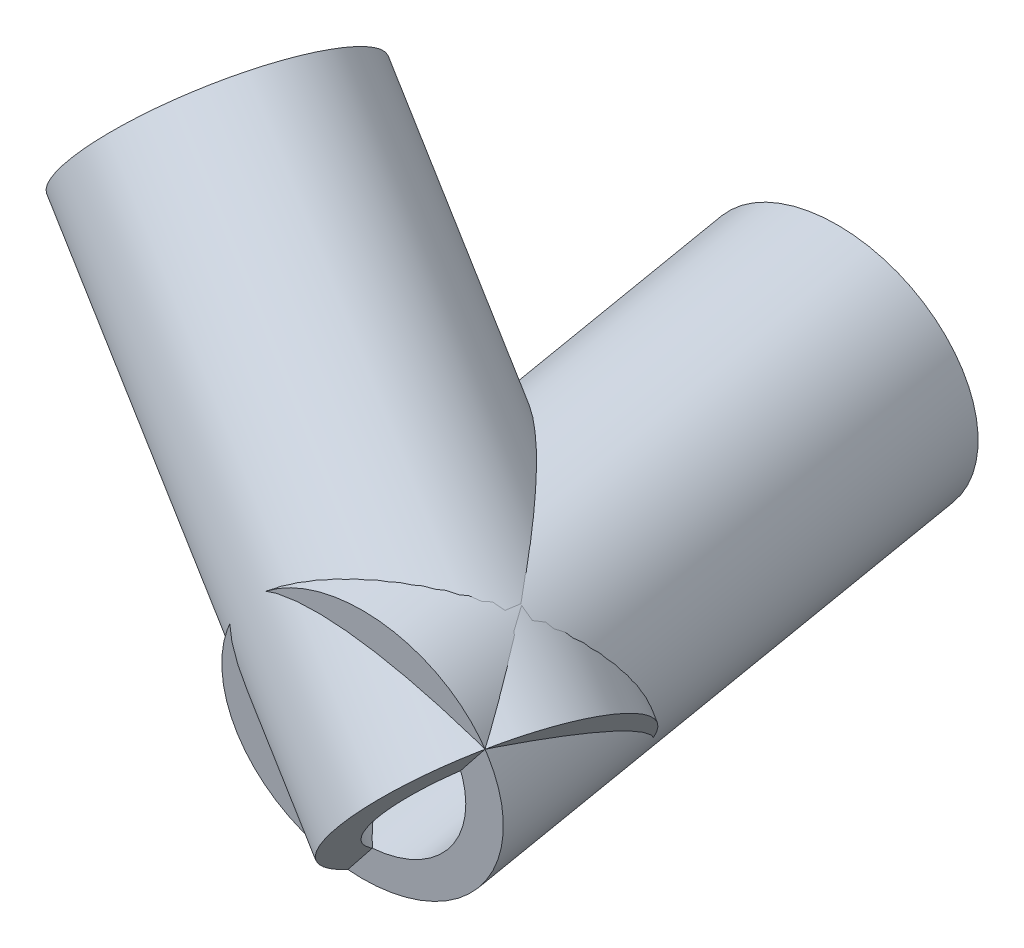
ISO-10303-21;
HEADER;
FILE_DESCRIPTION(('STEP AP214'),'2;1');
FILE_NAME('part.step','',(''),(''),'','','');
FILE_SCHEMA(('AUTOMOTIVE_DESIGN { 1 0 10303 214 1 1 1 1 }'));
ENDSEC;
DATA;
#1=APPLICATION_CONTEXT('core data for automotive mechanical design processes');
#2=APPLICATION_PROTOCOL_DEFINITION('international standard','automotive_design',2000,#1);
#3=PRODUCT_CONTEXT('',#1,'mechanical');
#4=PRODUCT('Part','Part','',(#3));
#5=PRODUCT_RELATED_PRODUCT_CATEGORY('part','',(#4));
#6=PRODUCT_DEFINITION_FORMATION('','',#4);
#7=PRODUCT_DEFINITION_CONTEXT('part definition',#1,'design');
#8=PRODUCT_DEFINITION('design','',#6,#7);
#9=PRODUCT_DEFINITION_SHAPE('','',#8);
#10=(LENGTH_UNIT() NAMED_UNIT(*) SI_UNIT(.MILLI.,.METRE.));
#11=(NAMED_UNIT(*) PLANE_ANGLE_UNIT() SI_UNIT($,.RADIAN.));
#12=(NAMED_UNIT(*) SI_UNIT($,.STERADIAN.) SOLID_ANGLE_UNIT());
#13=UNCERTAINTY_MEASURE_WITH_UNIT(LENGTH_MEASURE(1.E-05),#10,'distance_accuracy_value','');
#14=(GEOMETRIC_REPRESENTATION_CONTEXT(3) GLOBAL_UNCERTAINTY_ASSIGNED_CONTEXT((#13)) GLOBAL_UNIT_ASSIGNED_CONTEXT((#10,
#11,#12)) REPRESENTATION_CONTEXT('',''));
#15=CARTESIAN_POINT('',(0.,0.,0.));
#16=DIRECTION('',(0.,0.,1.));
#17=DIRECTION('',(1.,0.,0.));
#18=AXIS2_PLACEMENT_3D('',#15,#16,#17);
#19=CARTESIAN_POINT('',(-34.9878080110997,-17.9791132735098,-0.395982102381497));
#20=DIRECTION('',(0.752934660628481,-0.614285200098945,0.236099745369779));
#21=DIRECTION('',(0.632157021590929,0.774840306162041,0.));
#22=AXIS2_PLACEMENT_3D('',#19,#20,#21);
#23=PLANE('',#22);
#24=CARTESIAN_POINT('',(-26.1956533937152,-6.14285200098945,2.36099745369778));
#25=DIRECTION('',(0.752934660628481,-0.614285200098945,0.236099745369779));
#26=DIRECTION('',(0.632157021590929,0.774840306162041,0.));
#27=AXIS2_PLACEMENT_3D('',#24,#25,#26);
#28=CIRCLE('',#27,15.);
#29=CARTESIAN_POINT('',(-16.7132980698513,5.47975259144119,2.36099745369778));
#30=VERTEX_POINT('',#29);
#31=EDGE_CURVE('E51',#30,#30,#28,.T.);
#32=ORIENTED_EDGE('',*,*,#31,.T.);
#33=EDGE_LOOP('',(#32));
#34=FACE_BOUND('',#33,.T.);
#35=CARTESIAN_POINT('',(-26.1956533937152,-6.14285200098943,2.36099745369778));
#36=DIRECTION('',(0.752934660628481,-0.614285200098945,0.236099745369779));
#37=DIRECTION('',(0.632157021590929,0.774840306162041,0.));
#38=AXIS2_PLACEMENT_3D('',#35,#36,#37);
#39=CIRCLE('',#38,11.);
#40=CARTESIAN_POINT('',(-19.241926156215,2.38039136679302,2.36099745369778));
#41=VERTEX_POINT('',#40);
#42=EDGE_CURVE('E11',#41,#41,#39,.T.);
#43=ORIENTED_EDGE('',*,*,#42,.F.);
#44=EDGE_LOOP('',(#43));
#45=FACE_BOUND('',#44,.T.);
#46=ADVANCED_FACE('F45',(#34,#45),#23,.T.);
#47=CARTESIAN_POINT('',(-33.725,0.,0.));
#48=DIRECTION('',(0.752934660628481,-0.614285200098945,0.236099745369779));
#49=DIRECTION('',(0.632157021590929,0.774840306162041,0.));
#50=AXIS2_PLACEMENT_3D('',#47,#48,#49);
#51=CYLINDRICAL_SURFACE('',#50,15.);
#52=CARTESIAN_POINT('',(-71.3717330314241,30.7142600049472,-11.8049872684889));
#53=DIRECTION('',(0.752934660628481,-0.614285200098945,0.236099745369779));
#54=DIRECTION('',(0.632157021590929,0.774840306162041,0.));
#55=AXIS2_PLACEMENT_3D('',#52,#53,#54);
#56=CIRCLE('',#55,15.0000000000001);
#57=CARTESIAN_POINT('',(-61.8893777075601,42.3368645973779,-11.8049872684889));
#58=VERTEX_POINT('',#57);
#59=EDGE_CURVE('E55',#58,#58,#56,.T.);
#60=ORIENTED_EDGE('',*,*,#59,.T.);
#61=EDGE_LOOP('',(#60));
#62=FACE_BOUND('',#61,.T.);
#63=ORIENTED_EDGE('',*,*,#31,.F.);
#64=EDGE_LOOP('',(#63));
#65=FACE_BOUND('',#64,.T.);
#66=ADVANCED_FACE('F74',(#62,#65),#51,.T.);
#67=CARTESIAN_POINT('',(-80.1638876488086,18.8779987324268,-14.5619668245682));
#68=DIRECTION('',(-0.752934660628481,0.614285200098945,-0.236099745369779));
#69=DIRECTION('',(-0.632157021590929,-0.774840306162041,0.));
#70=AXIS2_PLACEMENT_3D('',#67,#68,#69);
#71=PLANE('',#70);
#72=CARTESIAN_POINT('',(-71.3717330314241,30.7142600049472,-11.8049872684889));
#73=DIRECTION('',(0.752934660628481,-0.614285200098945,0.236099745369779));
#74=DIRECTION('',(0.632157021590929,0.774840306162041,0.));
#75=AXIS2_PLACEMENT_3D('',#72,#73,#74);
#76=CIRCLE('',#75,11.);
#77=CARTESIAN_POINT('',(-64.4180057939238,39.2375033727297,-11.8049872684889));
#78=VERTEX_POINT('',#77);
#79=EDGE_CURVE('E59',#78,#78,#76,.T.);
#80=ORIENTED_EDGE('',*,*,#79,.T.);
#81=EDGE_LOOP('',(#80));
#82=FACE_BOUND('',#81,.T.);
#83=ORIENTED_EDGE('',*,*,#59,.F.);
#84=EDGE_LOOP('',(#83));
#85=FACE_BOUND('',#84,.T.);
#86=ADVANCED_FACE('F65',(#82,#85),#71,.T.);
#87=CARTESIAN_POINT('',(-33.725,0.,0.));
#88=DIRECTION('',(0.752934660628481,-0.614285200098945,0.236099745369779));
#89=DIRECTION('',(0.632157021590929,0.774840306162041,0.));
#90=AXIS2_PLACEMENT_3D('',#87,#88,#89);
#91=CYLINDRICAL_SURFACE('',#90,11.);
#92=ORIENTED_EDGE('',*,*,#42,.T.);
#93=EDGE_LOOP('',(#92));
#94=FACE_BOUND('',#93,.T.);
#95=ORIENTED_EDGE('',*,*,#79,.F.);
#96=EDGE_LOOP('',(#95));
#97=FACE_BOUND('',#96,.T.);
#98=ADVANCED_FACE('F68',(#94,#97),#91,.F.);
#99=CLOSED_SHELL('',(#46,#66,#86,#98));
#100=MANIFOLD_SOLID_BREP('B2',#99);
#101=CARTESIAN_POINT('',(-37.5768827287278,20.2030728466739,-47.9791501279057));
#102=DIRECTION('',(-0.0795762882833334,0.105743422663495,-0.991204289188892));
#103=DIRECTION('',(0.,0.994357617095155,0.106079825248941));
#104=AXIS2_PLACEMENT_3D('',#101,#102,#103);
#105=PLANE('',#104);
#106=CARTESIAN_POINT('',(-37.7038144141667,5.28717113317475,-49.5602144594446));
#107=DIRECTION('',(0.0795762882833334,-0.105743422663495,0.991204289188892));
#108=DIRECTION('',(0.,-0.994357617095155,-0.106079825248941));
#109=AXIS2_PLACEMENT_3D('',#106,#107,#108);
#110=CIRCLE('',#109,11.);
#111=CARTESIAN_POINT('',(-37.7038144141667,-5.65076265487199,-50.727092537183));
#112=VERTEX_POINT('',#111);
#113=EDGE_CURVE('E127',#112,#112,#110,.T.);
#114=ORIENTED_EDGE('',*,*,#113,.T.);
#115=EDGE_LOOP('',(#114));
#116=FACE_BOUND('',#115,.T.);
#117=CARTESIAN_POINT('',(-37.7038144141667,5.28717113317475,-49.5602144594446));
#118=DIRECTION('',(0.0795762882833334,-0.105743422663495,0.991204289188892));
#119=DIRECTION('',(0.,-0.994357617095155,-0.106079825248941));
#120=AXIS2_PLACEMENT_3D('',#117,#118,#119);
#121=CIRCLE('',#120,15.);
#122=CARTESIAN_POINT('',(-37.7038144141667,-9.62819312325258,-51.1514118381787));
#123=VERTEX_POINT('',#122);
#124=EDGE_CURVE('E44',#123,#123,#121,.T.);
#125=ORIENTED_EDGE('',*,*,#124,.F.);
#126=EDGE_LOOP('',(#125));
#127=FACE_BOUND('',#126,.T.);
#128=ADVANCED_FACE('F113',(#116,#127),#105,.T.);
#129=CARTESIAN_POINT('',(-33.725,0.,0.));
#130=DIRECTION('',(0.0795762882833334,-0.105743422663495,0.991204289188892));
#131=DIRECTION('',(0.,-0.994357617095155,-0.106079825248941));
#132=AXIS2_PLACEMENT_3D('',#129,#130,#131);
#133=CYLINDRICAL_SURFACE('',#132,15.);
#134=CARTESIAN_POINT('',(-32.9292371171667,-1.05743422663495,9.91204289188892));
#135=DIRECTION('',(0.0795762882833334,-0.105743422663495,0.991204289188892));
#136=DIRECTION('',(0.,-0.994357617095155,-0.106079825248941));
#137=AXIS2_PLACEMENT_3D('',#134,#135,#136);
#138=CIRCLE('',#137,15.);
#139=CARTESIAN_POINT('',(-32.9292371171667,-15.9727984830623,8.3208455131548));
#140=VERTEX_POINT('',#139);
#141=EDGE_CURVE('E119',#140,#140,#138,.T.);
#142=ORIENTED_EDGE('',*,*,#141,.F.);
#143=EDGE_LOOP('',(#142));
#144=FACE_BOUND('',#143,.T.);
#145=ORIENTED_EDGE('',*,*,#124,.T.);
#146=EDGE_LOOP('',(#145));
#147=FACE_BOUND('',#146,.T.);
#148=ADVANCED_FACE('F143',(#144,#147),#133,.T.);
#149=CARTESIAN_POINT('',(-32.8023054317278,13.8584674868642,11.4931072234278));
#150=DIRECTION('',(-0.0795762882833334,0.105743422663495,-0.991204289188892));
#151=DIRECTION('',(0.,0.994357617095155,0.106079825248941));
#152=AXIS2_PLACEMENT_3D('',#149,#150,#151);
#153=PLANE('',#152);
#154=CARTESIAN_POINT('',(-32.9292371171667,-1.05743422663495,9.91204289188892));
#155=DIRECTION('',(0.0795762882833334,-0.105743422663495,0.991204289188892));
#156=DIRECTION('',(0.,-0.994357617095155,-0.106079825248941));
#157=AXIS2_PLACEMENT_3D('',#154,#155,#156);
#158=CIRCLE('',#157,11.);
#159=CARTESIAN_POINT('',(-32.9292371171667,-11.9953680146817,8.74516481415057));
#160=VERTEX_POINT('',#159);
#161=EDGE_CURVE('E123',#160,#160,#158,.T.);
#162=ORIENTED_EDGE('',*,*,#161,.F.);
#163=EDGE_LOOP('',(#162));
#164=FACE_BOUND('',#163,.T.);
#165=ORIENTED_EDGE('',*,*,#141,.T.);
#166=EDGE_LOOP('',(#165));
#167=FACE_BOUND('',#166,.T.);
#168=ADVANCED_FACE('F138',(#164,#167),#153,.F.);
#169=CARTESIAN_POINT('',(-33.725,0.,0.));
#170=DIRECTION('',(0.0795762882833334,-0.105743422663495,0.991204289188892));
#171=DIRECTION('',(0.,-0.994357617095155,-0.106079825248941));
#172=AXIS2_PLACEMENT_3D('',#169,#170,#171);
#173=CYLINDRICAL_SURFACE('',#172,11.);
#174=ORIENTED_EDGE('',*,*,#113,.F.);
#175=EDGE_LOOP('',(#174));
#176=FACE_BOUND('',#175,.T.);
#177=ORIENTED_EDGE('',*,*,#161,.T.);
#178=EDGE_LOOP('',(#177));
#179=FACE_BOUND('',#178,.T.);
#180=ADVANCED_FACE('F135',(#176,#179),#173,.F.);
#181=CLOSED_SHELL('',(#128,#148,#168,#180));
#182=MANIFOLD_SOLID_BREP('B6',#181);
#183=ADVANCED_BREP_SHAPE_REPRESENTATION('',(#18,#100,#182),#14);
#184=SHAPE_DEFINITION_REPRESENTATION(#9,#183);
ENDSEC;
END-ISO-10303-21;
